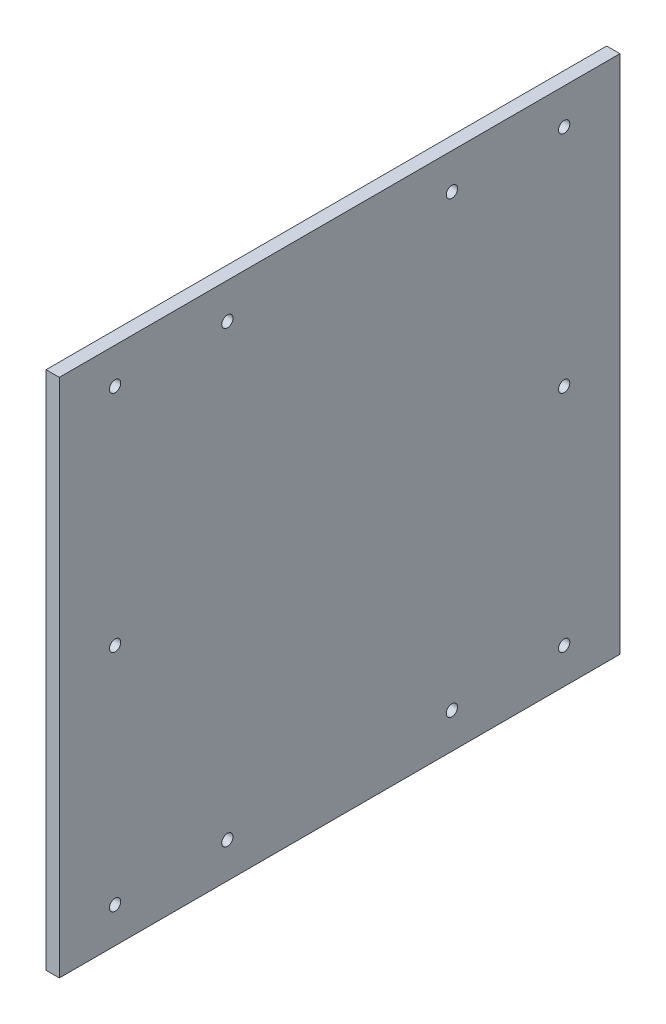
ISO-10303-21;
HEADER;
FILE_DESCRIPTION(('STEP AP214'),'2;1');
FILE_NAME('part.step','',(''),(''),'','','');
FILE_SCHEMA(('AUTOMOTIVE_DESIGN { 1 0 10303 214 1 1 1 1 }'));
ENDSEC;
DATA;
#1=APPLICATION_CONTEXT('core data for automotive mechanical design processes');
#2=APPLICATION_PROTOCOL_DEFINITION('international standard','automotive_design',2000,#1);
#3=PRODUCT_CONTEXT('',#1,'mechanical');
#4=PRODUCT('Part','Part','',(#3));
#5=PRODUCT_RELATED_PRODUCT_CATEGORY('part','',(#4));
#6=PRODUCT_DEFINITION_FORMATION('','',#4);
#7=PRODUCT_DEFINITION_CONTEXT('part definition',#1,'design');
#8=PRODUCT_DEFINITION('design','',#6,#7);
#9=PRODUCT_DEFINITION_SHAPE('','',#8);
#10=(LENGTH_UNIT() NAMED_UNIT(*) SI_UNIT(.MILLI.,.METRE.));
#11=(NAMED_UNIT(*) PLANE_ANGLE_UNIT() SI_UNIT($,.RADIAN.));
#12=(NAMED_UNIT(*) SI_UNIT($,.STERADIAN.) SOLID_ANGLE_UNIT());
#13=UNCERTAINTY_MEASURE_WITH_UNIT(LENGTH_MEASURE(1.E-05),#10,'distance_accuracy_value','');
#14=(GEOMETRIC_REPRESENTATION_CONTEXT(3) GLOBAL_UNCERTAINTY_ASSIGNED_CONTEXT((#13)) GLOBAL_UNIT_ASSIGNED_CONTEXT((#10,
#11,#12)) REPRESENTATION_CONTEXT('',''));
#15=CARTESIAN_POINT('',(0.,0.,0.));
#16=DIRECTION('',(0.,0.,1.));
#17=DIRECTION('',(1.,0.,0.));
#18=AXIS2_PLACEMENT_3D('',#15,#16,#17);
#19=CARTESIAN_POINT('',(6.,0.,0.));
#20=DIRECTION('',(-1.,0.,0.));
#21=DIRECTION('',(0.,0.,1.));
#22=AXIS2_PLACEMENT_3D('',#19,#20,#21);
#23=PLANE('',#22);
#24=CARTESIAN_POINT('',(6.,101.6,-50.8));
#25=DIRECTION('',(-1.,0.,0.));
#26=DIRECTION('',(0.,0.,1.));
#27=AXIS2_PLACEMENT_3D('',#24,#25,#26);
#28=CIRCLE('',#27,2.555);
#29=CARTESIAN_POINT('',(6.,101.6,-48.245));
#30=VERTEX_POINT('',#29);
#31=EDGE_CURVE('E206',#30,#30,#28,.T.);
#32=ORIENTED_EDGE('',*,*,#31,.T.);
#33=EDGE_LOOP('',(#32));
#34=FACE_BOUND('',#33,.T.);
#35=CARTESIAN_POINT('',(6.,-101.6,-101.6));
#36=DIRECTION('',(-1.,0.,0.));
#37=DIRECTION('',(0.,0.,1.));
#38=AXIS2_PLACEMENT_3D('',#35,#36,#37);
#39=CIRCLE('',#38,2.555);
#40=CARTESIAN_POINT('',(6.,-101.6,-99.045));
#41=VERTEX_POINT('',#40);
#42=EDGE_CURVE('E194',#41,#41,#39,.T.);
#43=ORIENTED_EDGE('',*,*,#42,.T.);
#44=EDGE_LOOP('',(#43));
#45=FACE_BOUND('',#44,.T.);
#46=CARTESIAN_POINT('',(6.,101.6,-101.6));
#47=DIRECTION('',(-1.,0.,0.));
#48=DIRECTION('',(0.,0.,1.));
#49=AXIS2_PLACEMENT_3D('',#46,#47,#48);
#50=CIRCLE('',#49,2.555);
#51=CARTESIAN_POINT('',(6.,101.6,-99.045));
#52=VERTEX_POINT('',#51);
#53=EDGE_CURVE('E190',#52,#52,#50,.F.);
#54=ORIENTED_EDGE('',*,*,#53,.F.);
#55=EDGE_LOOP('',(#54));
#56=FACE_BOUND('',#55,.T.);
#57=DIRECTION('',(0.,0.,1.));
#58=VECTOR('',#57,1.);
#59=CARTESIAN_POINT('',(6.,-117.7,-126.85));
#60=LINE('',#59,#58);
#61=CARTESIAN_POINT('',(6.,-117.7,-126.85));
#62=VERTEX_POINT('',#61);
#63=CARTESIAN_POINT('',(6.,-117.7,126.85));
#64=VERTEX_POINT('',#63);
#65=EDGE_CURVE('E110',#62,#64,#60,.T.);
#66=ORIENTED_EDGE('',*,*,#65,.F.);
#67=DIRECTION('',(0.,1.,0.));
#68=VECTOR('',#67,1.);
#69=CARTESIAN_POINT('',(6.,-117.7,-126.85));
#70=LINE('',#69,#68);
#71=CARTESIAN_POINT('',(6.,117.7,-126.85));
#72=VERTEX_POINT('',#71);
#73=EDGE_CURVE('E97',#62,#72,#70,.T.);
#74=ORIENTED_EDGE('',*,*,#73,.T.);
#75=DIRECTION('',(0.,0.,1.));
#76=VECTOR('',#75,1.);
#77=CARTESIAN_POINT('',(6.,117.7,-126.85));
#78=LINE('',#77,#76);
#79=CARTESIAN_POINT('',(6.,117.7,126.85));
#80=VERTEX_POINT('',#79);
#81=EDGE_CURVE('E92',#72,#80,#78,.T.);
#82=ORIENTED_EDGE('',*,*,#81,.T.);
#83=DIRECTION('',(0.,1.,0.));
#84=VECTOR('',#83,1.);
#85=CARTESIAN_POINT('',(6.,-117.7,126.85));
#86=LINE('',#85,#84);
#87=EDGE_CURVE('E96',#64,#80,#86,.T.);
#88=ORIENTED_EDGE('',*,*,#87,.F.);
#89=EDGE_LOOP('',(#66,#74,#82,#88));
#90=FACE_BOUND('',#89,.T.);
#91=CARTESIAN_POINT('',(6.,-101.6,101.6));
#92=DIRECTION('',(-1.,0.,0.));
#93=DIRECTION('',(0.,0.,1.));
#94=AXIS2_PLACEMENT_3D('',#91,#92,#93);
#95=CIRCLE('',#94,2.555);
#96=CARTESIAN_POINT('',(6.,-101.6,104.155));
#97=VERTEX_POINT('',#96);
#98=EDGE_CURVE('E174',#97,#97,#95,.F.);
#99=ORIENTED_EDGE('',*,*,#98,.F.);
#100=EDGE_LOOP('',(#99));
#101=FACE_BOUND('',#100,.T.);
#102=CARTESIAN_POINT('',(6.,0.,-101.6));
#103=DIRECTION('',(-1.,0.,0.));
#104=DIRECTION('',(0.,0.,1.));
#105=AXIS2_PLACEMENT_3D('',#102,#103,#104);
#106=CIRCLE('',#105,2.555);
#107=CARTESIAN_POINT('',(6.,0.,-99.045));
#108=VERTEX_POINT('',#107);
#109=EDGE_CURVE('E176',#108,#108,#106,.F.);
#110=ORIENTED_EDGE('',*,*,#109,.F.);
#111=EDGE_LOOP('',(#110));
#112=FACE_BOUND('',#111,.T.);
#113=CARTESIAN_POINT('',(6.,101.6,101.6));
#114=DIRECTION('',(-1.,0.,0.));
#115=DIRECTION('',(0.,0.,1.));
#116=AXIS2_PLACEMENT_3D('',#113,#114,#115);
#117=CIRCLE('',#116,2.555);
#118=CARTESIAN_POINT('',(6.,101.6,104.155));
#119=VERTEX_POINT('',#118);
#120=EDGE_CURVE('E181',#119,#119,#117,.T.);
#121=ORIENTED_EDGE('',*,*,#120,.T.);
#122=EDGE_LOOP('',(#121));
#123=FACE_BOUND('',#122,.T.);
#124=CARTESIAN_POINT('',(6.,-101.6,-50.8));
#125=DIRECTION('',(-1.,0.,0.));
#126=DIRECTION('',(0.,0.,1.));
#127=AXIS2_PLACEMENT_3D('',#124,#125,#126);
#128=CIRCLE('',#127,2.555);
#129=CARTESIAN_POINT('',(6.,-101.6,-48.245));
#130=VERTEX_POINT('',#129);
#131=EDGE_CURVE('E198',#130,#130,#128,.F.);
#132=ORIENTED_EDGE('',*,*,#131,.F.);
#133=EDGE_LOOP('',(#132));
#134=FACE_BOUND('',#133,.T.);
#135=CARTESIAN_POINT('',(6.,0.,101.6));
#136=DIRECTION('',(-1.,0.,0.));
#137=DIRECTION('',(0.,0.,1.));
#138=AXIS2_PLACEMENT_3D('',#135,#136,#137);
#139=CIRCLE('',#138,2.555);
#140=CARTESIAN_POINT('',(6.,0.,104.155));
#141=VERTEX_POINT('',#140);
#142=EDGE_CURVE('E202',#141,#141,#139,.T.);
#143=ORIENTED_EDGE('',*,*,#142,.T.);
#144=EDGE_LOOP('',(#143));
#145=FACE_BOUND('',#144,.T.);
#146=CARTESIAN_POINT('',(6.,101.6,50.8));
#147=DIRECTION('',(-1.,0.,0.));
#148=DIRECTION('',(0.,0.,1.));
#149=AXIS2_PLACEMENT_3D('',#146,#147,#148);
#150=CIRCLE('',#149,2.555);
#151=CARTESIAN_POINT('',(6.,101.6,53.355));
#152=VERTEX_POINT('',#151);
#153=EDGE_CURVE('E209',#152,#152,#150,.F.);
#154=ORIENTED_EDGE('',*,*,#153,.F.);
#155=EDGE_LOOP('',(#154));
#156=FACE_BOUND('',#155,.T.);
#157=CARTESIAN_POINT('',(6.,-101.6,50.8));
#158=DIRECTION('',(-1.,0.,0.));
#159=DIRECTION('',(0.,0.,1.));
#160=AXIS2_PLACEMENT_3D('',#157,#158,#159);
#161=CIRCLE('',#160,2.555);
#162=CARTESIAN_POINT('',(6.,-101.6,53.355));
#163=VERTEX_POINT('',#162);
#164=EDGE_CURVE('E123',#163,#163,#161,.T.);
#165=ORIENTED_EDGE('',*,*,#164,.T.);
#166=EDGE_LOOP('',(#165));
#167=FACE_BOUND('',#166,.T.);
#168=ADVANCED_FACE('F45',(#34,#45,#56,#90,#101,#112,#123,#134,#145,#156,#167),#23,.F.);
#169=CARTESIAN_POINT('',(0.,0.,0.));
#170=DIRECTION('',(-1.,0.,0.));
#171=DIRECTION('',(0.,0.,1.));
#172=AXIS2_PLACEMENT_3D('',#169,#170,#171);
#173=PLANE('',#172);
#174=CARTESIAN_POINT('',(0.,101.6,50.8));
#175=DIRECTION('',(1.,0.,0.));
#176=DIRECTION('',(0.,0.,-1.));
#177=AXIS2_PLACEMENT_3D('',#174,#175,#176);
#178=CIRCLE('',#177,2.555);
#179=CARTESIAN_POINT('',(0.,101.6,48.245));
#180=VERTEX_POINT('',#179);
#181=EDGE_CURVE('E271',#180,#180,#178,.T.);
#182=ORIENTED_EDGE('',*,*,#181,.T.);
#183=EDGE_LOOP('',(#182));
#184=FACE_BOUND('',#183,.T.);
#185=CARTESIAN_POINT('',(0.,-101.6,-50.8));
#186=DIRECTION('',(1.,0.,0.));
#187=DIRECTION('',(0.,0.,-1.));
#188=AXIS2_PLACEMENT_3D('',#185,#186,#187);
#189=CIRCLE('',#188,2.555);
#190=CARTESIAN_POINT('',(0.,-101.6,-53.355));
#191=VERTEX_POINT('',#190);
#192=EDGE_CURVE('E253',#191,#191,#189,.T.);
#193=ORIENTED_EDGE('',*,*,#192,.T.);
#194=EDGE_LOOP('',(#193));
#195=FACE_BOUND('',#194,.T.);
#196=CARTESIAN_POINT('',(0.,101.6,-101.6));
#197=DIRECTION('',(1.,0.,0.));
#198=DIRECTION('',(0.,0.,-1.));
#199=AXIS2_PLACEMENT_3D('',#196,#197,#198);
#200=CIRCLE('',#199,2.555);
#201=CARTESIAN_POINT('',(0.,101.6,-104.155));
#202=VERTEX_POINT('',#201);
#203=EDGE_CURVE('E269',#202,#202,#200,.T.);
#204=ORIENTED_EDGE('',*,*,#203,.T.);
#205=EDGE_LOOP('',(#204));
#206=FACE_BOUND('',#205,.T.);
#207=CARTESIAN_POINT('',(0.,0.,-101.6));
#208=DIRECTION('',(1.,0.,0.));
#209=DIRECTION('',(0.,0.,-1.));
#210=AXIS2_PLACEMENT_3D('',#207,#208,#209);
#211=CIRCLE('',#210,2.555);
#212=CARTESIAN_POINT('',(0.,0.,-104.155));
#213=VERTEX_POINT('',#212);
#214=EDGE_CURVE('E288',#213,#213,#211,.T.);
#215=ORIENTED_EDGE('',*,*,#214,.T.);
#216=EDGE_LOOP('',(#215));
#217=FACE_BOUND('',#216,.T.);
#218=CARTESIAN_POINT('',(0.,-101.6,101.6));
#219=DIRECTION('',(1.,0.,0.));
#220=DIRECTION('',(0.,0.,-1.));
#221=AXIS2_PLACEMENT_3D('',#218,#219,#220);
#222=CIRCLE('',#221,2.555);
#223=CARTESIAN_POINT('',(0.,-101.6,99.045));
#224=VERTEX_POINT('',#223);
#225=EDGE_CURVE('E171',#224,#224,#222,.T.);
#226=ORIENTED_EDGE('',*,*,#225,.T.);
#227=EDGE_LOOP('',(#226));
#228=FACE_BOUND('',#227,.T.);
#229=DIRECTION('',(0.,0.,1.));
#230=VECTOR('',#229,1.);
#231=CARTESIAN_POINT('',(0.,-117.7,-126.85));
#232=LINE('',#231,#230);
#233=CARTESIAN_POINT('',(0.,-117.7,-126.85));
#234=VERTEX_POINT('',#233);
#235=CARTESIAN_POINT('',(0.,-117.7,126.85));
#236=VERTEX_POINT('',#235);
#237=EDGE_CURVE('E118',#234,#236,#232,.T.);
#238=ORIENTED_EDGE('',*,*,#237,.T.);
#239=DIRECTION('',(0.,1.,0.));
#240=VECTOR('',#239,1.);
#241=CARTESIAN_POINT('',(0.,-117.7,126.85));
#242=LINE('',#241,#240);
#243=CARTESIAN_POINT('',(0.,117.7,126.85));
#244=VERTEX_POINT('',#243);
#245=EDGE_CURVE('E122',#236,#244,#242,.T.);
#246=ORIENTED_EDGE('',*,*,#245,.T.);
#247=DIRECTION('',(0.,0.,1.));
#248=VECTOR('',#247,1.);
#249=CARTESIAN_POINT('',(0.,117.7,-126.85));
#250=LINE('',#249,#248);
#251=CARTESIAN_POINT('',(0.,117.7,-126.85));
#252=VERTEX_POINT('',#251);
#253=EDGE_CURVE('E105',#252,#244,#250,.T.);
#254=ORIENTED_EDGE('',*,*,#253,.F.);
#255=DIRECTION('',(0.,1.,0.));
#256=VECTOR('',#255,1.);
#257=CARTESIAN_POINT('',(0.,-117.7,-126.85));
#258=LINE('',#257,#256);
#259=EDGE_CURVE('E80',#234,#252,#258,.T.);
#260=ORIENTED_EDGE('',*,*,#259,.F.);
#261=EDGE_LOOP('',(#238,#246,#254,#260));
#262=FACE_BOUND('',#261,.T.);
#263=CARTESIAN_POINT('',(0.,101.6,101.6));
#264=DIRECTION('',(-1.,0.,0.));
#265=DIRECTION('',(0.,0.,1.));
#266=AXIS2_PLACEMENT_3D('',#263,#264,#265);
#267=CIRCLE('',#266,2.555);
#268=CARTESIAN_POINT('',(0.,101.6,104.155));
#269=VERTEX_POINT('',#268);
#270=EDGE_CURVE('E183',#269,#269,#267,.T.);
#271=ORIENTED_EDGE('',*,*,#270,.F.);
#272=EDGE_LOOP('',(#271));
#273=FACE_BOUND('',#272,.T.);
#274=CARTESIAN_POINT('',(0.,-101.6,-101.6));
#275=DIRECTION('',(-1.,0.,0.));
#276=DIRECTION('',(0.,0.,1.));
#277=AXIS2_PLACEMENT_3D('',#274,#275,#276);
#278=CIRCLE('',#277,2.555);
#279=CARTESIAN_POINT('',(0.,-101.6,-99.045));
#280=VERTEX_POINT('',#279);
#281=EDGE_CURVE('E264',#280,#280,#278,.T.);
#282=ORIENTED_EDGE('',*,*,#281,.F.);
#283=EDGE_LOOP('',(#282));
#284=FACE_BOUND('',#283,.T.);
#285=CARTESIAN_POINT('',(0.,0.,101.6));
#286=DIRECTION('',(-1.,0.,0.));
#287=DIRECTION('',(0.,0.,1.));
#288=AXIS2_PLACEMENT_3D('',#285,#286,#287);
#289=CIRCLE('',#288,2.555);
#290=CARTESIAN_POINT('',(0.,0.,104.155));
#291=VERTEX_POINT('',#290);
#292=EDGE_CURVE('E284',#291,#291,#289,.T.);
#293=ORIENTED_EDGE('',*,*,#292,.F.);
#294=EDGE_LOOP('',(#293));
#295=FACE_BOUND('',#294,.T.);
#296=CARTESIAN_POINT('',(0.,101.6,-50.8));
#297=DIRECTION('',(-1.,0.,0.));
#298=DIRECTION('',(0.,0.,1.));
#299=AXIS2_PLACEMENT_3D('',#296,#297,#298);
#300=CIRCLE('',#299,2.555);
#301=CARTESIAN_POINT('',(0.,101.6,-48.245));
#302=VERTEX_POINT('',#301);
#303=EDGE_CURVE('E282',#302,#302,#300,.T.);
#304=ORIENTED_EDGE('',*,*,#303,.F.);
#305=EDGE_LOOP('',(#304));
#306=FACE_BOUND('',#305,.T.);
#307=CARTESIAN_POINT('',(0.,-101.6,50.8));
#308=DIRECTION('',(-1.,0.,0.));
#309=DIRECTION('',(0.,0.,1.));
#310=AXIS2_PLACEMENT_3D('',#307,#308,#309);
#311=CIRCLE('',#310,2.555);
#312=CARTESIAN_POINT('',(0.,-101.6,53.355));
#313=VERTEX_POINT('',#312);
#314=EDGE_CURVE('E265',#313,#313,#311,.T.);
#315=ORIENTED_EDGE('',*,*,#314,.F.);
#316=EDGE_LOOP('',(#315));
#317=FACE_BOUND('',#316,.T.);
#318=ADVANCED_FACE('F132',(#184,#195,#206,#217,#228,#262,#273,#284,#295,#306,#317),#173,.T.);
#319=CARTESIAN_POINT('',(6.,-117.7,-126.85));
#320=DIRECTION('',(0.,-1.,0.));
#321=DIRECTION('',(0.,0.,-1.));
#322=AXIS2_PLACEMENT_3D('',#319,#320,#321);
#323=PLANE('',#322);
#324=ORIENTED_EDGE('',*,*,#237,.F.);
#325=DIRECTION('',(-1.,0.,0.));
#326=VECTOR('',#325,1.);
#327=CARTESIAN_POINT('',(6.,-117.7,-126.85));
#328=LINE('',#327,#326);
#329=EDGE_CURVE('E11',#62,#234,#328,.T.);
#330=ORIENTED_EDGE('',*,*,#329,.F.);
#331=ORIENTED_EDGE('',*,*,#65,.T.);
#332=DIRECTION('',(-1.,0.,0.));
#333=VECTOR('',#332,1.);
#334=CARTESIAN_POINT('',(6.,-117.7,126.85));
#335=LINE('',#334,#333);
#336=EDGE_CURVE('E49',#64,#236,#335,.T.);
#337=ORIENTED_EDGE('',*,*,#336,.T.);
#338=EDGE_LOOP('',(#324,#330,#331,#337));
#339=FACE_BOUND('',#338,.T.);
#340=ADVANCED_FACE('F47',(#339),#323,.T.);
#341=CARTESIAN_POINT('',(6.,-117.7,-126.85));
#342=DIRECTION('',(0.,0.,1.));
#343=DIRECTION('',(1.,0.,0.));
#344=AXIS2_PLACEMENT_3D('',#341,#342,#343);
#345=PLANE('',#344);
#346=ORIENTED_EDGE('',*,*,#259,.T.);
#347=DIRECTION('',(-1.,0.,0.));
#348=VECTOR('',#347,1.);
#349=CARTESIAN_POINT('',(6.,117.7,-126.85));
#350=LINE('',#349,#348);
#351=EDGE_CURVE('E56',#72,#252,#350,.T.);
#352=ORIENTED_EDGE('',*,*,#351,.F.);
#353=ORIENTED_EDGE('',*,*,#73,.F.);
#354=ORIENTED_EDGE('',*,*,#329,.T.);
#355=EDGE_LOOP('',(#346,#352,#353,#354));
#356=FACE_BOUND('',#355,.T.);
#357=ADVANCED_FACE('F136',(#356),#345,.F.);
#358=CARTESIAN_POINT('',(6.,117.7,-126.85));
#359=DIRECTION('',(0.,-1.,0.));
#360=DIRECTION('',(0.,0.,-1.));
#361=AXIS2_PLACEMENT_3D('',#358,#359,#360);
#362=PLANE('',#361);
#363=ORIENTED_EDGE('',*,*,#253,.T.);
#364=DIRECTION('',(-1.,0.,0.));
#365=VECTOR('',#364,1.);
#366=CARTESIAN_POINT('',(6.,117.7,126.85));
#367=LINE('',#366,#365);
#368=EDGE_CURVE('E102',#80,#244,#367,.T.);
#369=ORIENTED_EDGE('',*,*,#368,.F.);
#370=ORIENTED_EDGE('',*,*,#81,.F.);
#371=ORIENTED_EDGE('',*,*,#351,.T.);
#372=EDGE_LOOP('',(#363,#369,#370,#371));
#373=FACE_BOUND('',#372,.T.);
#374=ADVANCED_FACE('F103',(#373),#362,.F.);
#375=CARTESIAN_POINT('',(6.,-117.7,126.85));
#376=DIRECTION('',(0.,0.,1.));
#377=DIRECTION('',(1.,0.,0.));
#378=AXIS2_PLACEMENT_3D('',#375,#376,#377);
#379=PLANE('',#378);
#380=ORIENTED_EDGE('',*,*,#245,.F.);
#381=ORIENTED_EDGE('',*,*,#336,.F.);
#382=ORIENTED_EDGE('',*,*,#87,.T.);
#383=ORIENTED_EDGE('',*,*,#368,.T.);
#384=EDGE_LOOP('',(#380,#381,#382,#383));
#385=FACE_BOUND('',#384,.T.);
#386=ADVANCED_FACE('F108',(#385),#379,.T.);
#387=CARTESIAN_POINT('',(10.,-101.6,101.6));
#388=DIRECTION('',(-1.,0.,0.));
#389=DIRECTION('',(0.,0.,1.));
#390=AXIS2_PLACEMENT_3D('',#387,#388,#389);
#391=CYLINDRICAL_SURFACE('',#390,2.555);
#392=ORIENTED_EDGE('',*,*,#225,.F.);
#393=EDGE_LOOP('',(#392));
#394=FACE_BOUND('',#393,.T.);
#395=ORIENTED_EDGE('',*,*,#98,.T.);
#396=EDGE_LOOP('',(#395));
#397=FACE_BOUND('',#396,.T.);
#398=ADVANCED_FACE('F153',(#394,#397),#391,.F.);
#399=CARTESIAN_POINT('',(10.,0.,-101.6));
#400=DIRECTION('',(-1.,0.,0.));
#401=DIRECTION('',(0.,0.,1.));
#402=AXIS2_PLACEMENT_3D('',#399,#400,#401);
#403=CYLINDRICAL_SURFACE('',#402,2.555);
#404=ORIENTED_EDGE('',*,*,#214,.F.);
#405=EDGE_LOOP('',(#404));
#406=FACE_BOUND('',#405,.T.);
#407=ORIENTED_EDGE('',*,*,#109,.T.);
#408=EDGE_LOOP('',(#407));
#409=FACE_BOUND('',#408,.T.);
#410=ADVANCED_FACE('F160',(#406,#409),#403,.F.);
#411=CARTESIAN_POINT('',(10.,101.6,101.6));
#412=DIRECTION('',(-1.,0.,0.));
#413=DIRECTION('',(0.,0.,1.));
#414=AXIS2_PLACEMENT_3D('',#411,#412,#413);
#415=CYLINDRICAL_SURFACE('',#414,2.555);
#416=ORIENTED_EDGE('',*,*,#270,.T.);
#417=EDGE_LOOP('',(#416));
#418=FACE_BOUND('',#417,.T.);
#419=ORIENTED_EDGE('',*,*,#120,.F.);
#420=EDGE_LOOP('',(#419));
#421=FACE_BOUND('',#420,.T.);
#422=ADVANCED_FACE('F165',(#418,#421),#415,.F.);
#423=CARTESIAN_POINT('',(10.,101.6,-101.6));
#424=DIRECTION('',(-1.,0.,0.));
#425=DIRECTION('',(0.,0.,1.));
#426=AXIS2_PLACEMENT_3D('',#423,#424,#425);
#427=CYLINDRICAL_SURFACE('',#426,2.555);
#428=ORIENTED_EDGE('',*,*,#203,.F.);
#429=EDGE_LOOP('',(#428));
#430=FACE_BOUND('',#429,.T.);
#431=ORIENTED_EDGE('',*,*,#53,.T.);
#432=EDGE_LOOP('',(#431));
#433=FACE_BOUND('',#432,.T.);
#434=ADVANCED_FACE('F235',(#430,#433),#427,.F.);
#435=CARTESIAN_POINT('',(10.,-101.6,-101.6));
#436=DIRECTION('',(-1.,0.,0.));
#437=DIRECTION('',(0.,0.,1.));
#438=AXIS2_PLACEMENT_3D('',#435,#436,#437);
#439=CYLINDRICAL_SURFACE('',#438,2.555);
#440=ORIENTED_EDGE('',*,*,#281,.T.);
#441=EDGE_LOOP('',(#440));
#442=FACE_BOUND('',#441,.T.);
#443=ORIENTED_EDGE('',*,*,#42,.F.);
#444=EDGE_LOOP('',(#443));
#445=FACE_BOUND('',#444,.T.);
#446=ADVANCED_FACE('F239',(#442,#445),#439,.F.);
#447=CARTESIAN_POINT('',(10.,-101.6,-50.8));
#448=DIRECTION('',(-1.,0.,0.));
#449=DIRECTION('',(0.,0.,1.));
#450=AXIS2_PLACEMENT_3D('',#447,#448,#449);
#451=CYLINDRICAL_SURFACE('',#450,2.555);
#452=ORIENTED_EDGE('',*,*,#192,.F.);
#453=EDGE_LOOP('',(#452));
#454=FACE_BOUND('',#453,.T.);
#455=ORIENTED_EDGE('',*,*,#131,.T.);
#456=EDGE_LOOP('',(#455));
#457=FACE_BOUND('',#456,.T.);
#458=ADVANCED_FACE('F242',(#454,#457),#451,.F.);
#459=CARTESIAN_POINT('',(10.,0.,101.6));
#460=DIRECTION('',(-1.,0.,0.));
#461=DIRECTION('',(0.,0.,1.));
#462=AXIS2_PLACEMENT_3D('',#459,#460,#461);
#463=CYLINDRICAL_SURFACE('',#462,2.555);
#464=ORIENTED_EDGE('',*,*,#292,.T.);
#465=EDGE_LOOP('',(#464));
#466=FACE_BOUND('',#465,.T.);
#467=ORIENTED_EDGE('',*,*,#142,.F.);
#468=EDGE_LOOP('',(#467));
#469=FACE_BOUND('',#468,.T.);
#470=ADVANCED_FACE('F230',(#466,#469),#463,.F.);
#471=CARTESIAN_POINT('',(10.,101.6,-50.8));
#472=DIRECTION('',(-1.,0.,0.));
#473=DIRECTION('',(0.,0.,1.));
#474=AXIS2_PLACEMENT_3D('',#471,#472,#473);
#475=CYLINDRICAL_SURFACE('',#474,2.555);
#476=ORIENTED_EDGE('',*,*,#303,.T.);
#477=EDGE_LOOP('',(#476));
#478=FACE_BOUND('',#477,.T.);
#479=ORIENTED_EDGE('',*,*,#31,.F.);
#480=EDGE_LOOP('',(#479));
#481=FACE_BOUND('',#480,.T.);
#482=ADVANCED_FACE('F225',(#478,#481),#475,.F.);
#483=CARTESIAN_POINT('',(10.,101.6,50.8));
#484=DIRECTION('',(-1.,0.,0.));
#485=DIRECTION('',(0.,0.,1.));
#486=AXIS2_PLACEMENT_3D('',#483,#484,#485);
#487=CYLINDRICAL_SURFACE('',#486,2.555);
#488=ORIENTED_EDGE('',*,*,#181,.F.);
#489=EDGE_LOOP('',(#488));
#490=FACE_BOUND('',#489,.T.);
#491=ORIENTED_EDGE('',*,*,#153,.T.);
#492=EDGE_LOOP('',(#491));
#493=FACE_BOUND('',#492,.T.);
#494=ADVANCED_FACE('F219',(#490,#493),#487,.F.);
#495=CARTESIAN_POINT('',(10.,-101.6,50.8));
#496=DIRECTION('',(-1.,0.,0.));
#497=DIRECTION('',(0.,0.,1.));
#498=AXIS2_PLACEMENT_3D('',#495,#496,#497);
#499=CYLINDRICAL_SURFACE('',#498,2.555);
#500=ORIENTED_EDGE('',*,*,#314,.T.);
#501=EDGE_LOOP('',(#500));
#502=FACE_BOUND('',#501,.T.);
#503=ORIENTED_EDGE('',*,*,#164,.F.);
#504=EDGE_LOOP('',(#503));
#505=FACE_BOUND('',#504,.T.);
#506=ADVANCED_FACE('F217',(#502,#505),#499,.F.);
#507=CLOSED_SHELL('',(#168,#318,#340,#357,#374,#386,#398,#410,#422,#434,#446,#458,#470,#482,
#494,#506));
#508=MANIFOLD_SOLID_BREP('B2',#507);
#509=ADVANCED_BREP_SHAPE_REPRESENTATION('',(#18,#508),#14);
#510=SHAPE_DEFINITION_REPRESENTATION(#9,#509);
ENDSEC;
END-ISO-10303-21;
